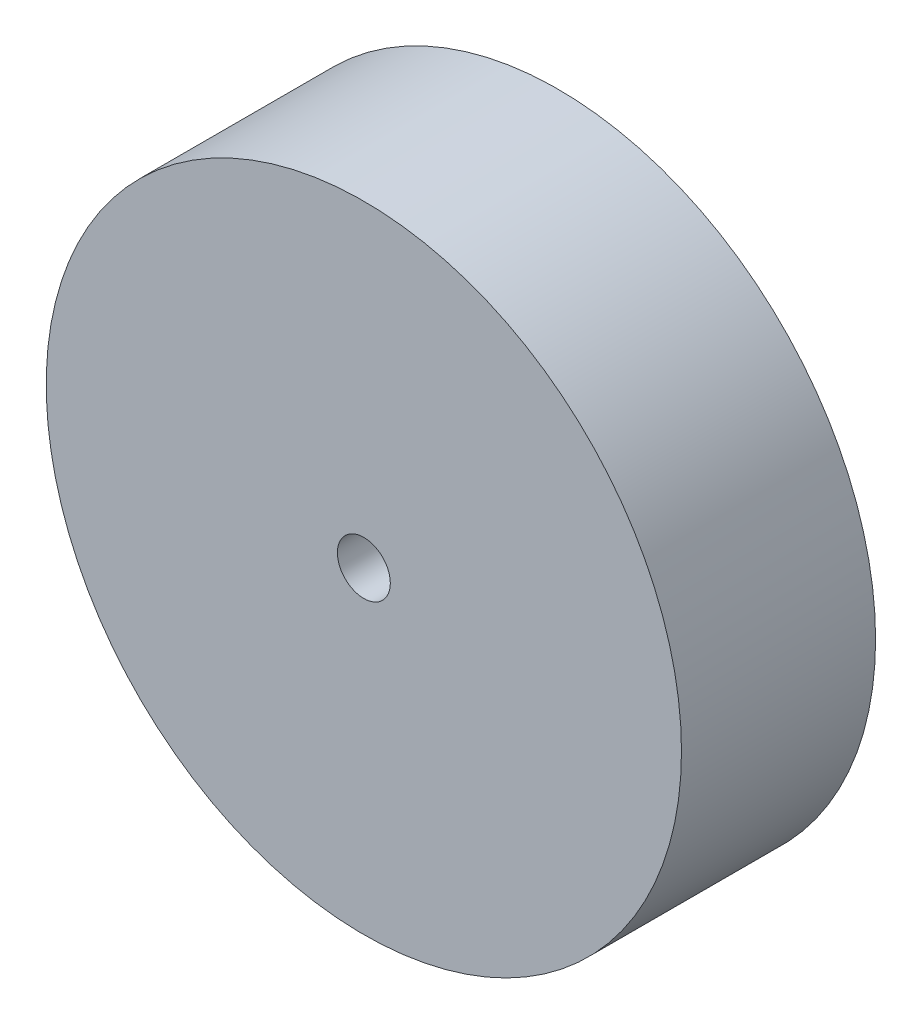
ISO-10303-21;
HEADER;
FILE_DESCRIPTION(('STEP AP214'),'2;1');
FILE_NAME('part.step','',(''),(''),'','','');
FILE_SCHEMA(('AUTOMOTIVE_DESIGN { 1 0 10303 214 1 1 1 1 }'));
ENDSEC;
DATA;
#1=APPLICATION_CONTEXT('core data for automotive mechanical design processes');
#2=APPLICATION_PROTOCOL_DEFINITION('international standard','automotive_design',2000,#1);
#3=PRODUCT_CONTEXT('',#1,'mechanical');
#4=PRODUCT('Part','Part','',(#3));
#5=PRODUCT_RELATED_PRODUCT_CATEGORY('part','',(#4));
#6=PRODUCT_DEFINITION_FORMATION('','',#4);
#7=PRODUCT_DEFINITION_CONTEXT('part definition',#1,'design');
#8=PRODUCT_DEFINITION('design','',#6,#7);
#9=PRODUCT_DEFINITION_SHAPE('','',#8);
#10=(LENGTH_UNIT() NAMED_UNIT(*) SI_UNIT(.MILLI.,.METRE.));
#11=(NAMED_UNIT(*) PLANE_ANGLE_UNIT() SI_UNIT($,.RADIAN.));
#12=(NAMED_UNIT(*) SI_UNIT($,.STERADIAN.) SOLID_ANGLE_UNIT());
#13=UNCERTAINTY_MEASURE_WITH_UNIT(LENGTH_MEASURE(1.E-05),#10,'distance_accuracy_value','');
#14=(GEOMETRIC_REPRESENTATION_CONTEXT(3) GLOBAL_UNCERTAINTY_ASSIGNED_CONTEXT((#13)) GLOBAL_UNIT_ASSIGNED_CONTEXT((#10,
#11,#12)) REPRESENTATION_CONTEXT('',''));
#15=CARTESIAN_POINT('',(0.,0.,0.));
#16=DIRECTION('',(0.,0.,1.));
#17=DIRECTION('',(1.,0.,0.));
#18=AXIS2_PLACEMENT_3D('',#15,#16,#17);
#19=CARTESIAN_POINT('',(0.,0.,3.));
#20=DIRECTION('',(0.,0.,-1.));
#21=DIRECTION('',(-1.,0.,0.));
#22=AXIS2_PLACEMENT_3D('',#19,#20,#21);
#23=CYLINDRICAL_SURFACE('',#22,2.75);
#24=CARTESIAN_POINT('',(0.,0.,3.));
#25=DIRECTION('',(0.,0.,1.));
#26=DIRECTION('',(1.,0.,0.));
#27=AXIS2_PLACEMENT_3D('',#24,#25,#26);
#28=CIRCLE('',#27,2.75);
#29=CARTESIAN_POINT('',(2.75,0.,3.));
#30=VERTEX_POINT('',#29);
#31=EDGE_CURVE('E42',#30,#30,#28,.T.);
#32=ORIENTED_EDGE('',*,*,#31,.F.);
#33=EDGE_LOOP('',(#32));
#34=FACE_BOUND('',#33,.T.);
#35=CARTESIAN_POINT('',(0.,0.,0.));
#36=DIRECTION('',(0.,0.,1.));
#37=DIRECTION('',(1.,0.,0.));
#38=AXIS2_PLACEMENT_3D('',#35,#36,#37);
#39=CIRCLE('',#38,2.75);
#40=CARTESIAN_POINT('',(2.75,0.,0.));
#41=VERTEX_POINT('',#40);
#42=EDGE_CURVE('E46',#41,#41,#39,.T.);
#43=ORIENTED_EDGE('',*,*,#42,.T.);
#44=EDGE_LOOP('',(#43));
#45=FACE_BOUND('',#44,.T.);
#46=ADVANCED_FACE('F31',(#34,#45),#23,.T.);
#47=CARTESIAN_POINT('',(0.,0.,0.));
#48=DIRECTION('',(0.,0.,1.));
#49=DIRECTION('',(1.,0.,0.));
#50=AXIS2_PLACEMENT_3D('',#47,#48,#49);
#51=PLANE('',#50);
#52=ORIENTED_EDGE('',*,*,#42,.F.);
#53=EDGE_LOOP('',(#52));
#54=FACE_BOUND('',#53,.T.);
#55=ADVANCED_FACE('F73',(#54),#51,.F.);
#56=CARTESIAN_POINT('',(0.,0.,8.5));
#57=DIRECTION('',(0.,0.,-1.));
#58=DIRECTION('',(-1.,0.,0.));
#59=AXIS2_PLACEMENT_3D('',#56,#57,#58);
#60=CYLINDRICAL_SURFACE('',#59,9.);
#61=CARTESIAN_POINT('',(0.,0.,8.5));
#62=DIRECTION('',(0.,0.,1.));
#63=DIRECTION('',(1.,0.,0.));
#64=AXIS2_PLACEMENT_3D('',#61,#62,#63);
#65=CIRCLE('',#64,9.);
#66=CARTESIAN_POINT('',(9.,0.,8.5));
#67=VERTEX_POINT('',#66);
#68=EDGE_CURVE('E50',#67,#67,#65,.T.);
#69=ORIENTED_EDGE('',*,*,#68,.F.);
#70=EDGE_LOOP('',(#69));
#71=FACE_BOUND('',#70,.T.);
#72=CARTESIAN_POINT('',(0.,0.,3.));
#73=DIRECTION('',(0.,0.,1.));
#74=DIRECTION('',(1.,0.,0.));
#75=AXIS2_PLACEMENT_3D('',#72,#73,#74);
#76=CIRCLE('',#75,9.);
#77=CARTESIAN_POINT('',(9.,0.,3.));
#78=VERTEX_POINT('',#77);
#79=EDGE_CURVE('E52',#78,#78,#76,.T.);
#80=ORIENTED_EDGE('',*,*,#79,.T.);
#81=EDGE_LOOP('',(#80));
#82=FACE_BOUND('',#81,.T.);
#83=ADVANCED_FACE('F67',(#71,#82),#60,.T.);
#84=CARTESIAN_POINT('',(0.,0.,8.5));
#85=DIRECTION('',(0.,0.,1.));
#86=DIRECTION('',(1.,0.,0.));
#87=AXIS2_PLACEMENT_3D('',#84,#85,#86);
#88=PLANE('',#87);
#89=CARTESIAN_POINT('',(0.,0.,8.5));
#90=DIRECTION('',(0.,0.,1.));
#91=DIRECTION('',(1.,0.,0.));
#92=AXIS2_PLACEMENT_3D('',#89,#90,#91);
#93=CIRCLE('',#92,0.75);
#94=CARTESIAN_POINT('',(0.75,0.,8.5));
#95=VERTEX_POINT('',#94);
#96=EDGE_CURVE('E55',#95,#95,#93,.T.);
#97=ORIENTED_EDGE('',*,*,#96,.F.);
#98=EDGE_LOOP('',(#97));
#99=FACE_BOUND('',#98,.T.);
#100=ORIENTED_EDGE('',*,*,#68,.T.);
#101=EDGE_LOOP('',(#100));
#102=FACE_BOUND('',#101,.T.);
#103=ADVANCED_FACE('F63',(#99,#102),#88,.T.);
#104=CARTESIAN_POINT('',(0.,0.,3.));
#105=DIRECTION('',(0.,0.,1.));
#106=DIRECTION('',(1.,0.,0.));
#107=AXIS2_PLACEMENT_3D('',#104,#105,#106);
#108=PLANE('',#107);
#109=ORIENTED_EDGE('',*,*,#31,.T.);
#110=EDGE_LOOP('',(#109));
#111=FACE_BOUND('',#110,.T.);
#112=ORIENTED_EDGE('',*,*,#79,.F.);
#113=EDGE_LOOP('',(#112));
#114=FACE_BOUND('',#113,.T.);
#115=ADVANCED_FACE('F66',(#111,#114),#108,.F.);
#116=CARTESIAN_POINT('',(0.,0.,1.));
#117=DIRECTION('',(0.,0.,1.));
#118=DIRECTION('',(1.,0.,0.));
#119=AXIS2_PLACEMENT_3D('',#116,#117,#118);
#120=CYLINDRICAL_SURFACE('',#119,0.75);
#121=CARTESIAN_POINT('',(0.,0.,1.7));
#122=DIRECTION('',(0.,0.,1.));
#123=DIRECTION('',(1.,0.,0.));
#124=AXIS2_PLACEMENT_3D('',#121,#122,#123);
#125=CIRCLE('',#124,0.75);
#126=CARTESIAN_POINT('',(0.75,0.,1.7));
#127=VERTEX_POINT('',#126);
#128=EDGE_CURVE('E10',#127,#127,#125,.F.);
#129=ORIENTED_EDGE('',*,*,#128,.T.);
#130=EDGE_LOOP('',(#129));
#131=FACE_BOUND('',#130,.T.);
#132=ORIENTED_EDGE('',*,*,#96,.T.);
#133=EDGE_LOOP('',(#132));
#134=FACE_BOUND('',#133,.T.);
#135=ADVANCED_FACE('F61',(#131,#134),#120,.F.);
#136=CARTESIAN_POINT('',(0.,0.,1.));
#137=DIRECTION('',(0.,0.,1.));
#138=DIRECTION('',(1.,0.,0.));
#139=AXIS2_PLACEMENT_3D('',#136,#137,#138);
#140=PLANE('',#139);
#141=CARTESIAN_POINT('',(0.,0.,1.));
#142=DIRECTION('',(0.,0.,1.));
#143=DIRECTION('',(1.,0.,0.));
#144=AXIS2_PLACEMENT_3D('',#141,#142,#143);
#145=CIRCLE('',#144,0.049999999999998);
#146=CARTESIAN_POINT('',(0.049999999999998,0.,1.));
#147=VERTEX_POINT('',#146);
#148=EDGE_CURVE('E38',#147,#147,#145,.T.);
#149=ORIENTED_EDGE('',*,*,#148,.T.);
#150=EDGE_LOOP('',(#149));
#151=FACE_BOUND('',#150,.T.);
#152=ADVANCED_FACE('F83',(#151),#140,.T.);
#153=CARTESIAN_POINT('',(0.,0.,1.));
#154=DIRECTION('',(0.,0.,1.));
#155=DIRECTION('',(1.,0.,0.));
#156=AXIS2_PLACEMENT_3D('',#153,#154,#155);
#157=CONICAL_SURFACE('',#156,0.049999999999998,0.785398163397451);
#158=ORIENTED_EDGE('',*,*,#128,.F.);
#159=EDGE_LOOP('',(#158));
#160=FACE_BOUND('',#159,.T.);
#161=ORIENTED_EDGE('',*,*,#148,.F.);
#162=EDGE_LOOP('',(#161));
#163=FACE_BOUND('',#162,.T.);
#164=ADVANCED_FACE('F33',(#160,#163),#157,.F.);
#165=CLOSED_SHELL('',(#46,#55,#83,#103,#115,#135,#152,#164));
#166=MANIFOLD_SOLID_BREP('B2',#165);
#167=ADVANCED_BREP_SHAPE_REPRESENTATION('',(#18,#166),#14);
#168=SHAPE_DEFINITION_REPRESENTATION(#9,#167);
ENDSEC;
END-ISO-10303-21;
